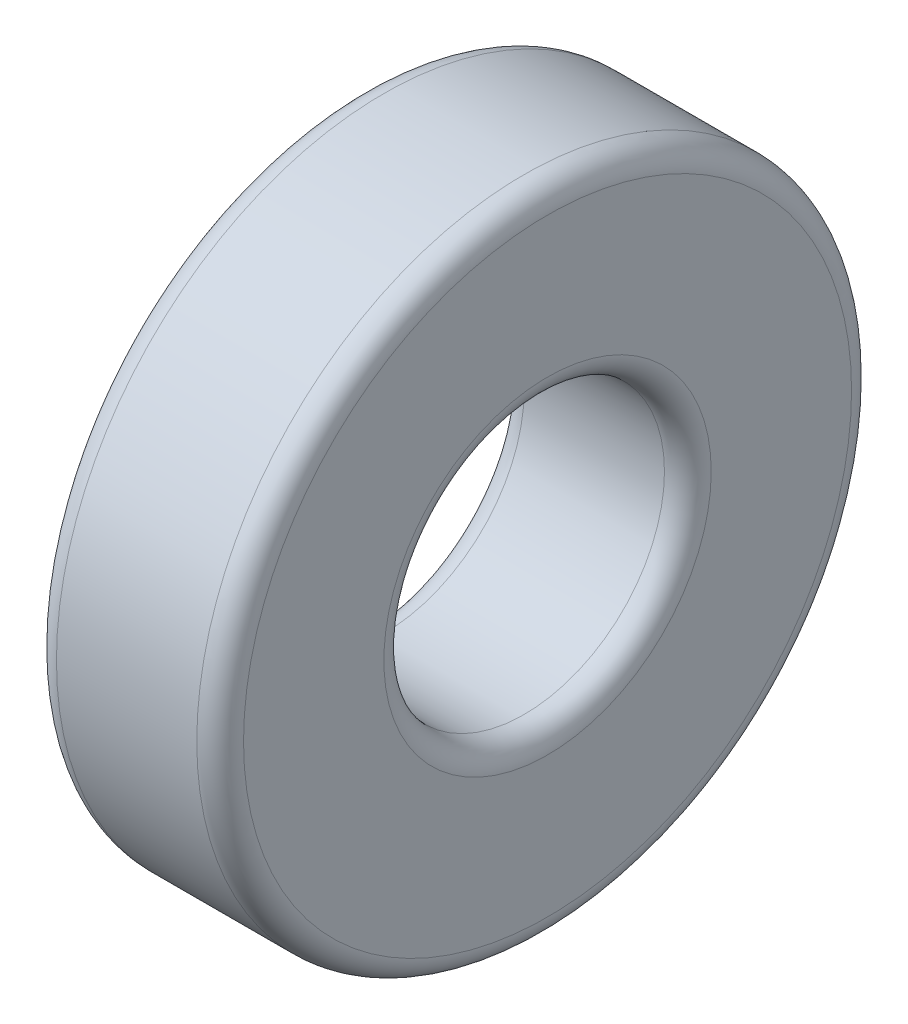
ISO-10303-21;
HEADER;
FILE_DESCRIPTION(('STEP AP214'),'2;1');
FILE_NAME('part.step','',(''),(''),'','','');
FILE_SCHEMA(('AUTOMOTIVE_DESIGN { 1 0 10303 214 1 1 1 1 }'));
ENDSEC;
DATA;
#1=APPLICATION_CONTEXT('core data for automotive mechanical design processes');
#2=APPLICATION_PROTOCOL_DEFINITION('international standard','automotive_design',2000,#1);
#3=PRODUCT_CONTEXT('',#1,'mechanical');
#4=PRODUCT('Part','Part','',(#3));
#5=PRODUCT_RELATED_PRODUCT_CATEGORY('part','',(#4));
#6=PRODUCT_DEFINITION_FORMATION('','',#4);
#7=PRODUCT_DEFINITION_CONTEXT('part definition',#1,'design');
#8=PRODUCT_DEFINITION('design','',#6,#7);
#9=PRODUCT_DEFINITION_SHAPE('','',#8);
#10=(LENGTH_UNIT() NAMED_UNIT(*) SI_UNIT(.MILLI.,.METRE.));
#11=(NAMED_UNIT(*) PLANE_ANGLE_UNIT() SI_UNIT($,.RADIAN.));
#12=(NAMED_UNIT(*) SI_UNIT($,.STERADIAN.) SOLID_ANGLE_UNIT());
#13=UNCERTAINTY_MEASURE_WITH_UNIT(LENGTH_MEASURE(1.E-05),#10,'distance_accuracy_value','');
#14=(GEOMETRIC_REPRESENTATION_CONTEXT(3) GLOBAL_UNCERTAINTY_ASSIGNED_CONTEXT((#13)) GLOBAL_UNIT_ASSIGNED_CONTEXT((#10,
#11,#12)) REPRESENTATION_CONTEXT('',''));
#15=CARTESIAN_POINT('',(0.,0.,0.));
#16=DIRECTION('',(0.,0.,1.));
#17=DIRECTION('',(1.,0.,0.));
#18=AXIS2_PLACEMENT_3D('',#15,#16,#17);
#19=CARTESIAN_POINT('',(-7.,0.,0.));
#20=DIRECTION('',(1.,0.,0.));
#21=DIRECTION('',(0.,0.,-1.));
#22=AXIS2_PLACEMENT_3D('',#19,#20,#21);
#23=TOROIDAL_SURFACE('',#22,13.,1.);
#24=CARTESIAN_POINT('',(-8.,0.,0.));
#25=DIRECTION('',(1.,0.,0.));
#26=DIRECTION('',(0.,0.,-1.));
#27=AXIS2_PLACEMENT_3D('',#24,#25,#26);
#28=CIRCLE('',#27,13.);
#29=CARTESIAN_POINT('',(-8.,0.,-13.));
#30=VERTEX_POINT('',#29);
#31=EDGE_CURVE('E10',#30,#30,#28,.T.);
#32=ORIENTED_EDGE('',*,*,#31,.T.);
#33=EDGE_LOOP('',(#32));
#34=FACE_BOUND('',#33,.T.);
#35=CARTESIAN_POINT('',(-6.99999999999999,0.,0.));
#36=DIRECTION('',(1.,0.,0.));
#37=DIRECTION('',(0.,0.,-1.));
#38=AXIS2_PLACEMENT_3D('',#35,#36,#37);
#39=CIRCLE('',#38,14.);
#40=CARTESIAN_POINT('',(-6.99999999999999,0.,-14.));
#41=VERTEX_POINT('',#40);
#42=EDGE_CURVE('E60',#41,#41,#39,.T.);
#43=ORIENTED_EDGE('',*,*,#42,.F.);
#44=EDGE_LOOP('',(#43));
#45=FACE_BOUND('',#44,.T.);
#46=ADVANCED_FACE('F32',(#34,#45),#23,.T.);
#47=CARTESIAN_POINT('',(-8.,13.,0.));
#48=DIRECTION('',(-1.,0.,0.));
#49=DIRECTION('',(0.,0.,1.));
#50=AXIS2_PLACEMENT_3D('',#47,#48,#49);
#51=PLANE('',#50);
#52=CARTESIAN_POINT('',(-8.,0.,0.));
#53=DIRECTION('',(1.,0.,0.));
#54=DIRECTION('',(0.,0.,-1.));
#55=AXIS2_PLACEMENT_3D('',#52,#53,#54);
#56=CIRCLE('',#55,7.00000000000001);
#57=CARTESIAN_POINT('',(-8.,0.,-7.00000000000001));
#58=VERTEX_POINT('',#57);
#59=EDGE_CURVE('E38',#58,#58,#56,.T.);
#60=ORIENTED_EDGE('',*,*,#59,.T.);
#61=EDGE_LOOP('',(#60));
#62=FACE_BOUND('',#61,.T.);
#63=ORIENTED_EDGE('',*,*,#31,.F.);
#64=EDGE_LOOP('',(#63));
#65=FACE_BOUND('',#64,.T.);
#66=ADVANCED_FACE('F68',(#62,#65),#51,.T.);
#67=CARTESIAN_POINT('',(-7.,0.,0.));
#68=DIRECTION('',(1.,0.,0.));
#69=DIRECTION('',(0.,0.,-1.));
#70=AXIS2_PLACEMENT_3D('',#67,#68,#69);
#71=TOROIDAL_SURFACE('',#70,7.,1.);
#72=CARTESIAN_POINT('',(-6.99999999999999,0.,0.));
#73=DIRECTION('',(1.,0.,0.));
#74=DIRECTION('',(0.,0.,-1.));
#75=AXIS2_PLACEMENT_3D('',#72,#73,#74);
#76=CIRCLE('',#75,6.);
#77=CARTESIAN_POINT('',(-6.99999999999999,0.,-6.));
#78=VERTEX_POINT('',#77);
#79=EDGE_CURVE('E42',#78,#78,#76,.T.);
#80=ORIENTED_EDGE('',*,*,#79,.T.);
#81=EDGE_LOOP('',(#80));
#82=FACE_BOUND('',#81,.T.);
#83=ORIENTED_EDGE('',*,*,#59,.F.);
#84=EDGE_LOOP('',(#83));
#85=FACE_BOUND('',#84,.T.);
#86=ADVANCED_FACE('F72',(#82,#85),#71,.T.);
#87=CARTESIAN_POINT('',(0.,0.,0.));
#88=DIRECTION('',(1.,0.,0.));
#89=DIRECTION('',(0.,0.,-1.));
#90=AXIS2_PLACEMENT_3D('',#87,#88,#89);
#91=CYLINDRICAL_SURFACE('',#90,6.);
#92=CARTESIAN_POINT('',(-1.00000000000001,0.,0.));
#93=DIRECTION('',(1.,0.,0.));
#94=DIRECTION('',(0.,0.,-1.));
#95=AXIS2_PLACEMENT_3D('',#92,#93,#94);
#96=CIRCLE('',#95,6.);
#97=CARTESIAN_POINT('',(-1.00000000000001,0.,-6.));
#98=VERTEX_POINT('',#97);
#99=EDGE_CURVE('E46',#98,#98,#96,.T.);
#100=ORIENTED_EDGE('',*,*,#99,.T.);
#101=EDGE_LOOP('',(#100));
#102=FACE_BOUND('',#101,.T.);
#103=ORIENTED_EDGE('',*,*,#79,.F.);
#104=EDGE_LOOP('',(#103));
#105=FACE_BOUND('',#104,.T.);
#106=ADVANCED_FACE('F76',(#102,#105),#91,.F.);
#107=CARTESIAN_POINT('',(-1.,0.,0.));
#108=DIRECTION('',(1.,0.,0.));
#109=DIRECTION('',(0.,0.,-1.));
#110=AXIS2_PLACEMENT_3D('',#107,#108,#109);
#111=TOROIDAL_SURFACE('',#110,7.,1.);
#112=CARTESIAN_POINT('',(0.,0.,0.));
#113=DIRECTION('',(1.,0.,0.));
#114=DIRECTION('',(0.,0.,-1.));
#115=AXIS2_PLACEMENT_3D('',#112,#113,#114);
#116=CIRCLE('',#115,7.00000000000001);
#117=CARTESIAN_POINT('',(0.,0.,-7.00000000000001));
#118=VERTEX_POINT('',#117);
#119=EDGE_CURVE('E51',#118,#118,#116,.T.);
#120=ORIENTED_EDGE('',*,*,#119,.T.);
#121=EDGE_LOOP('',(#120));
#122=FACE_BOUND('',#121,.T.);
#123=ORIENTED_EDGE('',*,*,#99,.F.);
#124=EDGE_LOOP('',(#123));
#125=FACE_BOUND('',#124,.T.);
#126=ADVANCED_FACE('F83',(#122,#125),#111,.T.);
#127=CARTESIAN_POINT('',(0.,7.00000000000001,0.));
#128=DIRECTION('',(1.,0.,0.));
#129=DIRECTION('',(0.,0.,-1.));
#130=AXIS2_PLACEMENT_3D('',#127,#128,#129);
#131=PLANE('',#130);
#132=CARTESIAN_POINT('',(0.,0.,0.));
#133=DIRECTION('',(1.,0.,0.));
#134=DIRECTION('',(0.,0.,-1.));
#135=AXIS2_PLACEMENT_3D('',#132,#133,#134);
#136=CIRCLE('',#135,13.);
#137=CARTESIAN_POINT('',(0.,0.,-13.));
#138=VERTEX_POINT('',#137);
#139=EDGE_CURVE('E54',#138,#138,#136,.T.);
#140=ORIENTED_EDGE('',*,*,#139,.T.);
#141=EDGE_LOOP('',(#140));
#142=FACE_BOUND('',#141,.T.);
#143=ORIENTED_EDGE('',*,*,#119,.F.);
#144=EDGE_LOOP('',(#143));
#145=FACE_BOUND('',#144,.T.);
#146=ADVANCED_FACE('F87',(#142,#145),#131,.T.);
#147=CARTESIAN_POINT('',(-1.,0.,0.));
#148=DIRECTION('',(1.,0.,0.));
#149=DIRECTION('',(0.,0.,-1.));
#150=AXIS2_PLACEMENT_3D('',#147,#148,#149);
#151=TOROIDAL_SURFACE('',#150,13.,1.);
#152=CARTESIAN_POINT('',(-1.00000000000001,0.,0.));
#153=DIRECTION('',(1.,0.,0.));
#154=DIRECTION('',(0.,0.,-1.));
#155=AXIS2_PLACEMENT_3D('',#152,#153,#154);
#156=CIRCLE('',#155,14.);
#157=CARTESIAN_POINT('',(-1.00000000000001,0.,-14.));
#158=VERTEX_POINT('',#157);
#159=EDGE_CURVE('E57',#158,#158,#156,.T.);
#160=ORIENTED_EDGE('',*,*,#159,.T.);
#161=EDGE_LOOP('',(#160));
#162=FACE_BOUND('',#161,.T.);
#163=ORIENTED_EDGE('',*,*,#139,.F.);
#164=EDGE_LOOP('',(#163));
#165=FACE_BOUND('',#164,.T.);
#166=ADVANCED_FACE('F91',(#162,#165),#151,.T.);
#167=CARTESIAN_POINT('',(0.,0.,0.));
#168=DIRECTION('',(1.,0.,0.));
#169=DIRECTION('',(0.,0.,-1.));
#170=AXIS2_PLACEMENT_3D('',#167,#168,#169);
#171=CYLINDRICAL_SURFACE('',#170,14.);
#172=ORIENTED_EDGE('',*,*,#42,.T.);
#173=EDGE_LOOP('',(#172));
#174=FACE_BOUND('',#173,.T.);
#175=ORIENTED_EDGE('',*,*,#159,.F.);
#176=EDGE_LOOP('',(#175));
#177=FACE_BOUND('',#176,.T.);
#178=ADVANCED_FACE('F64',(#174,#177),#171,.T.);
#179=CLOSED_SHELL('',(#46,#66,#86,#106,#126,#146,#166,#178));
#180=MANIFOLD_SOLID_BREP('B2',#179);
#181=ADVANCED_BREP_SHAPE_REPRESENTATION('',(#18,#180),#14);
#182=SHAPE_DEFINITION_REPRESENTATION(#9,#181);
ENDSEC;
END-ISO-10303-21;
